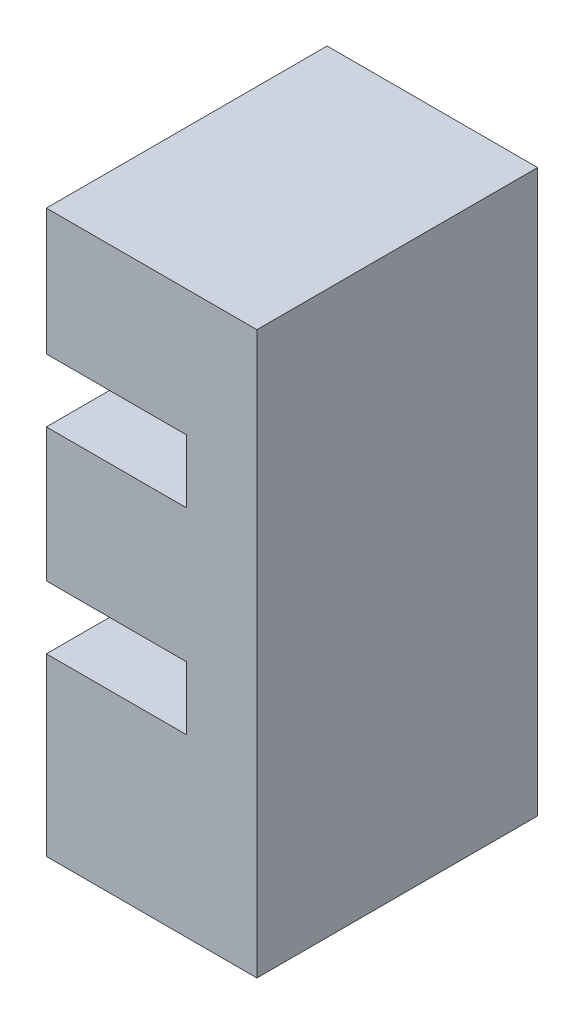
ISO-10303-21;
HEADER;
FILE_DESCRIPTION(('STEP AP214'),'2;1');
FILE_NAME('part.step','',(''),(''),'','','');
FILE_SCHEMA(('AUTOMOTIVE_DESIGN { 1 0 10303 214 1 1 1 1 }'));
ENDSEC;
DATA;
#1=APPLICATION_CONTEXT('core data for automotive mechanical design processes');
#2=APPLICATION_PROTOCOL_DEFINITION('international standard','automotive_design',2000,#1);
#3=PRODUCT_CONTEXT('',#1,'mechanical');
#4=PRODUCT('Part','Part','',(#3));
#5=PRODUCT_RELATED_PRODUCT_CATEGORY('part','',(#4));
#6=PRODUCT_DEFINITION_FORMATION('','',#4);
#7=PRODUCT_DEFINITION_CONTEXT('part definition',#1,'design');
#8=PRODUCT_DEFINITION('design','',#6,#7);
#9=PRODUCT_DEFINITION_SHAPE('','',#8);
#10=(LENGTH_UNIT() NAMED_UNIT(*) SI_UNIT(.MILLI.,.METRE.));
#11=(NAMED_UNIT(*) PLANE_ANGLE_UNIT() SI_UNIT($,.RADIAN.));
#12=(NAMED_UNIT(*) SI_UNIT($,.STERADIAN.) SOLID_ANGLE_UNIT());
#13=UNCERTAINTY_MEASURE_WITH_UNIT(LENGTH_MEASURE(1.E-05),#10,'distance_accuracy_value','');
#14=(GEOMETRIC_REPRESENTATION_CONTEXT(3) GLOBAL_UNCERTAINTY_ASSIGNED_CONTEXT((#13)) GLOBAL_UNIT_ASSIGNED_CONTEXT((#10,
#11,#12)) REPRESENTATION_CONTEXT('',''));
#15=CARTESIAN_POINT('',(0.,0.,0.));
#16=DIRECTION('',(0.,0.,1.));
#17=DIRECTION('',(1.,0.,0.));
#18=AXIS2_PLACEMENT_3D('',#15,#16,#17);
#19=CARTESIAN_POINT('',(1.905,4.572,5.08));
#20=DIRECTION('',(-1.,0.,0.));
#21=DIRECTION('',(0.,-1.,0.));
#22=AXIS2_PLACEMENT_3D('',#19,#20,#21);
#23=PLANE('',#22);
#24=DIRECTION('',(0.,1.,0.));
#25=VECTOR('',#24,1.);
#26=CARTESIAN_POINT('',(1.905,4.572,0.));
#27=LINE('',#26,#25);
#28=CARTESIAN_POINT('',(1.905,-5.588,0.));
#29=VERTEX_POINT('',#28);
#30=CARTESIAN_POINT('',(1.905,4.572,0.));
#31=VERTEX_POINT('',#30);
#32=EDGE_CURVE('E153',#29,#31,#27,.T.);
#33=ORIENTED_EDGE('',*,*,#32,.T.);
#34=DIRECTION('',(0.,0.,-1.));
#35=VECTOR('',#34,1.);
#36=CARTESIAN_POINT('',(1.905,4.572,5.08));
#37=LINE('',#36,#35);
#38=CARTESIAN_POINT('',(1.905,4.572,5.08));
#39=VERTEX_POINT('',#38);
#40=EDGE_CURVE('E11',#39,#31,#37,.T.);
#41=ORIENTED_EDGE('',*,*,#40,.F.);
#42=DIRECTION('',(0.,1.,0.));
#43=VECTOR('',#42,1.);
#44=CARTESIAN_POINT('',(1.905,4.572,5.08));
#45=LINE('',#44,#43);
#46=CARTESIAN_POINT('',(1.905,-5.588,5.08));
#47=VERTEX_POINT('',#46);
#48=EDGE_CURVE('E175',#47,#39,#45,.T.);
#49=ORIENTED_EDGE('',*,*,#48,.F.);
#50=DIRECTION('',(0.,0.,-1.));
#51=VECTOR('',#50,1.);
#52=CARTESIAN_POINT('',(1.905,-5.588,5.08));
#53=LINE('',#52,#51);
#54=EDGE_CURVE('E149',#47,#29,#53,.T.);
#55=ORIENTED_EDGE('',*,*,#54,.T.);
#56=EDGE_LOOP('',(#33,#41,#49,#55));
#57=FACE_BOUND('',#56,.T.);
#58=ADVANCED_FACE('F33',(#57),#23,.F.);
#59=CARTESIAN_POINT('',(-1.905,4.572,5.08));
#60=DIRECTION('',(0.,-1.,0.));
#61=DIRECTION('',(0.,0.,-1.));
#62=AXIS2_PLACEMENT_3D('',#59,#60,#61);
#63=PLANE('',#62);
#64=DIRECTION('',(-1.,0.,0.));
#65=VECTOR('',#64,1.);
#66=CARTESIAN_POINT('',(-1.905,4.572,0.));
#67=LINE('',#66,#65);
#68=CARTESIAN_POINT('',(-1.905,4.572,0.));
#69=VERTEX_POINT('',#68);
#70=EDGE_CURVE('E156',#31,#69,#67,.T.);
#71=ORIENTED_EDGE('',*,*,#70,.T.);
#72=DIRECTION('',(0.,0.,-1.));
#73=VECTOR('',#72,1.);
#74=CARTESIAN_POINT('',(-1.905,4.572,5.08));
#75=LINE('',#74,#73);
#76=CARTESIAN_POINT('',(-1.905,4.572,5.08));
#77=VERTEX_POINT('',#76);
#78=EDGE_CURVE('E41',#77,#69,#75,.T.);
#79=ORIENTED_EDGE('',*,*,#78,.F.);
#80=DIRECTION('',(-1.,0.,0.));
#81=VECTOR('',#80,1.);
#82=CARTESIAN_POINT('',(-1.905,4.572,5.08));
#83=LINE('',#82,#81);
#84=EDGE_CURVE('E104',#39,#77,#83,.T.);
#85=ORIENTED_EDGE('',*,*,#84,.F.);
#86=ORIENTED_EDGE('',*,*,#40,.T.);
#87=EDGE_LOOP('',(#71,#79,#85,#86));
#88=FACE_BOUND('',#87,.T.);
#89=ADVANCED_FACE('F253',(#88),#63,.F.);
#90=CARTESIAN_POINT('',(-1.905,2.286,5.08));
#91=DIRECTION('',(1.,0.,0.));
#92=DIRECTION('',(0.,1.,0.));
#93=AXIS2_PLACEMENT_3D('',#90,#91,#92);
#94=PLANE('',#93);
#95=DIRECTION('',(0.,-1.,0.));
#96=VECTOR('',#95,1.);
#97=CARTESIAN_POINT('',(-1.905,2.286,0.));
#98=LINE('',#97,#96);
#99=CARTESIAN_POINT('',(-1.905,2.286,0.));
#100=VERTEX_POINT('',#99);
#101=EDGE_CURVE('E158',#69,#100,#98,.T.);
#102=ORIENTED_EDGE('',*,*,#101,.T.);
#103=DIRECTION('',(0.,0.,-1.));
#104=VECTOR('',#103,1.);
#105=CARTESIAN_POINT('',(-1.905,2.286,5.08));
#106=LINE('',#105,#104);
#107=CARTESIAN_POINT('',(-1.905,2.286,5.08));
#108=VERTEX_POINT('',#107);
#109=EDGE_CURVE('E194',#108,#100,#106,.T.);
#110=ORIENTED_EDGE('',*,*,#109,.F.);
#111=DIRECTION('',(0.,-1.,0.));
#112=VECTOR('',#111,1.);
#113=CARTESIAN_POINT('',(-1.905,2.286,5.08));
#114=LINE('',#113,#112);
#115=EDGE_CURVE('E202',#77,#108,#114,.T.);
#116=ORIENTED_EDGE('',*,*,#115,.F.);
#117=ORIENTED_EDGE('',*,*,#78,.T.);
#118=EDGE_LOOP('',(#102,#110,#116,#117));
#119=FACE_BOUND('',#118,.T.);
#120=ADVANCED_FACE('F200',(#119),#94,.F.);
#121=CARTESIAN_POINT('',(0.635000000000001,2.286,5.08));
#122=DIRECTION('',(0.,1.,0.));
#123=DIRECTION('',(-1.,0.,0.));
#124=AXIS2_PLACEMENT_3D('',#121,#122,#123);
#125=PLANE('',#124);
#126=DIRECTION('',(1.,0.,0.));
#127=VECTOR('',#126,1.);
#128=CARTESIAN_POINT('',(0.635000000000001,2.286,0.));
#129=LINE('',#128,#127);
#130=CARTESIAN_POINT('',(0.635000000000001,2.286,0.));
#131=VERTEX_POINT('',#130);
#132=EDGE_CURVE('E160',#100,#131,#129,.T.);
#133=ORIENTED_EDGE('',*,*,#132,.T.);
#134=DIRECTION('',(0.,0.,-1.));
#135=VECTOR('',#134,1.);
#136=CARTESIAN_POINT('',(0.635000000000001,2.286,5.08));
#137=LINE('',#136,#135);
#138=CARTESIAN_POINT('',(0.635000000000001,2.286,5.08));
#139=VERTEX_POINT('',#138);
#140=EDGE_CURVE('E191',#139,#131,#137,.T.);
#141=ORIENTED_EDGE('',*,*,#140,.F.);
#142=DIRECTION('',(1.,0.,0.));
#143=VECTOR('',#142,1.);
#144=CARTESIAN_POINT('',(0.635000000000001,2.286,5.08));
#145=LINE('',#144,#143);
#146=EDGE_CURVE('E220',#108,#139,#145,.T.);
#147=ORIENTED_EDGE('',*,*,#146,.F.);
#148=ORIENTED_EDGE('',*,*,#109,.T.);
#149=EDGE_LOOP('',(#133,#141,#147,#148));
#150=FACE_BOUND('',#149,.T.);
#151=ADVANCED_FACE('F211',(#150),#125,.F.);
#152=CARTESIAN_POINT('',(0.635000000000001,1.143,5.08));
#153=DIRECTION('',(1.,0.,0.));
#154=DIRECTION('',(0.,0.,-1.));
#155=AXIS2_PLACEMENT_3D('',#152,#153,#154);
#156=PLANE('',#155);
#157=DIRECTION('',(0.,-1.,0.));
#158=VECTOR('',#157,1.);
#159=CARTESIAN_POINT('',(0.635000000000001,1.143,0.));
#160=LINE('',#159,#158);
#161=CARTESIAN_POINT('',(0.635000000000001,1.143,0.));
#162=VERTEX_POINT('',#161);
#163=EDGE_CURVE('E162',#131,#162,#160,.T.);
#164=ORIENTED_EDGE('',*,*,#163,.T.);
#165=DIRECTION('',(0.,0.,-1.));
#166=VECTOR('',#165,1.);
#167=CARTESIAN_POINT('',(0.635000000000001,1.143,5.08));
#168=LINE('',#167,#166);
#169=CARTESIAN_POINT('',(0.635000000000001,1.143,5.08));
#170=VERTEX_POINT('',#169);
#171=EDGE_CURVE('E188',#170,#162,#168,.T.);
#172=ORIENTED_EDGE('',*,*,#171,.F.);
#173=DIRECTION('',(0.,-1.,0.));
#174=VECTOR('',#173,1.);
#175=CARTESIAN_POINT('',(0.635000000000001,1.143,5.08));
#176=LINE('',#175,#174);
#177=EDGE_CURVE('E217',#139,#170,#176,.T.);
#178=ORIENTED_EDGE('',*,*,#177,.F.);
#179=ORIENTED_EDGE('',*,*,#140,.T.);
#180=EDGE_LOOP('',(#164,#172,#178,#179));
#181=FACE_BOUND('',#180,.T.);
#182=ADVANCED_FACE('F215',(#181),#156,.F.);
#183=CARTESIAN_POINT('',(-1.905,1.143,5.08));
#184=DIRECTION('',(0.,-1.,0.));
#185=DIRECTION('',(0.,0.,-1.));
#186=AXIS2_PLACEMENT_3D('',#183,#184,#185);
#187=PLANE('',#186);
#188=DIRECTION('',(-1.,0.,0.));
#189=VECTOR('',#188,1.);
#190=CARTESIAN_POINT('',(-1.905,1.143,0.));
#191=LINE('',#190,#189);
#192=CARTESIAN_POINT('',(-1.905,1.143,0.));
#193=VERTEX_POINT('',#192);
#194=EDGE_CURVE('E164',#162,#193,#191,.T.);
#195=ORIENTED_EDGE('',*,*,#194,.T.);
#196=DIRECTION('',(0.,0.,-1.));
#197=VECTOR('',#196,1.);
#198=CARTESIAN_POINT('',(-1.905,1.143,5.08));
#199=LINE('',#198,#197);
#200=CARTESIAN_POINT('',(-1.905,1.143,5.08));
#201=VERTEX_POINT('',#200);
#202=EDGE_CURVE('E185',#201,#193,#199,.T.);
#203=ORIENTED_EDGE('',*,*,#202,.F.);
#204=DIRECTION('',(-1.,0.,0.));
#205=VECTOR('',#204,1.);
#206=CARTESIAN_POINT('',(-1.905,1.143,5.08));
#207=LINE('',#206,#205);
#208=EDGE_CURVE('E219',#170,#201,#207,.T.);
#209=ORIENTED_EDGE('',*,*,#208,.F.);
#210=ORIENTED_EDGE('',*,*,#171,.T.);
#211=EDGE_LOOP('',(#195,#203,#209,#210));
#212=FACE_BOUND('',#211,.T.);
#213=ADVANCED_FACE('F266',(#212),#187,.F.);
#214=CARTESIAN_POINT('',(-1.905,1.143,5.08));
#215=DIRECTION('',(1.,0.,0.));
#216=DIRECTION('',(0.,0.,-1.));
#217=AXIS2_PLACEMENT_3D('',#214,#215,#216);
#218=PLANE('',#217);
#219=DIRECTION('',(0.,-1.,0.));
#220=VECTOR('',#219,1.);
#221=CARTESIAN_POINT('',(-1.905,1.143,0.));
#222=LINE('',#221,#220);
#223=CARTESIAN_POINT('',(-1.905,-1.27,0.));
#224=VERTEX_POINT('',#223);
#225=EDGE_CURVE('E166',#193,#224,#222,.T.);
#226=ORIENTED_EDGE('',*,*,#225,.T.);
#227=DIRECTION('',(0.,0.,-1.));
#228=VECTOR('',#227,1.);
#229=CARTESIAN_POINT('',(-1.905,-1.27,5.08));
#230=LINE('',#229,#228);
#231=CARTESIAN_POINT('',(-1.905,-1.27,5.08));
#232=VERTEX_POINT('',#231);
#233=EDGE_CURVE('E182',#232,#224,#230,.T.);
#234=ORIENTED_EDGE('',*,*,#233,.F.);
#235=DIRECTION('',(0.,-1.,0.));
#236=VECTOR('',#235,1.);
#237=CARTESIAN_POINT('',(-1.905,1.143,5.08));
#238=LINE('',#237,#236);
#239=EDGE_CURVE('E222',#201,#232,#238,.T.);
#240=ORIENTED_EDGE('',*,*,#239,.F.);
#241=ORIENTED_EDGE('',*,*,#202,.T.);
#242=EDGE_LOOP('',(#226,#234,#240,#241));
#243=FACE_BOUND('',#242,.T.);
#244=ADVANCED_FACE('F269',(#243),#218,.F.);
#245=CARTESIAN_POINT('',(-1.905,-1.27,5.08));
#246=DIRECTION('',(0.,1.,0.));
#247=DIRECTION('',(-1.,0.,0.));
#248=AXIS2_PLACEMENT_3D('',#245,#246,#247);
#249=PLANE('',#248);
#250=DIRECTION('',(1.,0.,0.));
#251=VECTOR('',#250,1.);
#252=CARTESIAN_POINT('',(-1.905,-1.27,0.));
#253=LINE('',#252,#251);
#254=CARTESIAN_POINT('',(0.635000000000001,-1.27,0.));
#255=VERTEX_POINT('',#254);
#256=EDGE_CURVE('E168',#224,#255,#253,.T.);
#257=ORIENTED_EDGE('',*,*,#256,.T.);
#258=DIRECTION('',(0.,0.,-1.));
#259=VECTOR('',#258,1.);
#260=CARTESIAN_POINT('',(0.635000000000001,-1.27,5.08));
#261=LINE('',#260,#259);
#262=CARTESIAN_POINT('',(0.635000000000001,-1.27,5.08));
#263=VERTEX_POINT('',#262);
#264=EDGE_CURVE('E179',#263,#255,#261,.T.);
#265=ORIENTED_EDGE('',*,*,#264,.F.);
#266=DIRECTION('',(1.,0.,0.));
#267=VECTOR('',#266,1.);
#268=CARTESIAN_POINT('',(-1.905,-1.27,5.08));
#269=LINE('',#268,#267);
#270=EDGE_CURVE('E228',#232,#263,#269,.T.);
#271=ORIENTED_EDGE('',*,*,#270,.F.);
#272=ORIENTED_EDGE('',*,*,#233,.T.);
#273=EDGE_LOOP('',(#257,#265,#271,#272));
#274=FACE_BOUND('',#273,.T.);
#275=ADVANCED_FACE('F234',(#274),#249,.F.);
#276=CARTESIAN_POINT('',(0.635000000000001,-1.27,5.08));
#277=DIRECTION('',(1.,0.,0.));
#278=DIRECTION('',(0.,0.,-1.));
#279=AXIS2_PLACEMENT_3D('',#276,#277,#278);
#280=PLANE('',#279);
#281=DIRECTION('',(0.,-1.,0.));
#282=VECTOR('',#281,1.);
#283=CARTESIAN_POINT('',(0.635000000000001,-1.27,0.));
#284=LINE('',#283,#282);
#285=CARTESIAN_POINT('',(0.635000000000001,-2.413,0.));
#286=VERTEX_POINT('',#285);
#287=EDGE_CURVE('E170',#255,#286,#284,.T.);
#288=ORIENTED_EDGE('',*,*,#287,.T.);
#289=DIRECTION('',(0.,0.,-1.));
#290=VECTOR('',#289,1.);
#291=CARTESIAN_POINT('',(0.635000000000001,-2.413,5.08));
#292=LINE('',#291,#290);
#293=CARTESIAN_POINT('',(0.635000000000001,-2.413,5.08));
#294=VERTEX_POINT('',#293);
#295=EDGE_CURVE('E144',#294,#286,#292,.T.);
#296=ORIENTED_EDGE('',*,*,#295,.F.);
#297=DIRECTION('',(0.,-1.,0.));
#298=VECTOR('',#297,1.);
#299=CARTESIAN_POINT('',(0.635000000000001,-1.27,5.08));
#300=LINE('',#299,#298);
#301=EDGE_CURVE('E135',#263,#294,#300,.T.);
#302=ORIENTED_EDGE('',*,*,#301,.F.);
#303=ORIENTED_EDGE('',*,*,#264,.T.);
#304=EDGE_LOOP('',(#288,#296,#302,#303));
#305=FACE_BOUND('',#304,.T.);
#306=ADVANCED_FACE('F238',(#305),#280,.F.);
#307=CARTESIAN_POINT('',(0.635000000000001,-2.413,5.08));
#308=DIRECTION('',(0.,-1.,0.));
#309=DIRECTION('',(0.,0.,-1.));
#310=AXIS2_PLACEMENT_3D('',#307,#308,#309);
#311=PLANE('',#310);
#312=DIRECTION('',(-1.,0.,0.));
#313=VECTOR('',#312,1.);
#314=CARTESIAN_POINT('',(0.635000000000001,-2.413,0.));
#315=LINE('',#314,#313);
#316=CARTESIAN_POINT('',(-1.905,-2.413,0.));
#317=VERTEX_POINT('',#316);
#318=EDGE_CURVE('E143',#286,#317,#315,.T.);
#319=ORIENTED_EDGE('',*,*,#318,.T.);
#320=DIRECTION('',(0.,0.,-1.));
#321=VECTOR('',#320,1.);
#322=CARTESIAN_POINT('',(-1.905,-2.413,5.08));
#323=LINE('',#322,#321);
#324=CARTESIAN_POINT('',(-1.905,-2.413,5.08));
#325=VERTEX_POINT('',#324);
#326=EDGE_CURVE('E140',#325,#317,#323,.T.);
#327=ORIENTED_EDGE('',*,*,#326,.F.);
#328=DIRECTION('',(-1.,0.,0.));
#329=VECTOR('',#328,1.);
#330=CARTESIAN_POINT('',(0.635000000000001,-2.413,5.08));
#331=LINE('',#330,#329);
#332=EDGE_CURVE('E129',#294,#325,#331,.T.);
#333=ORIENTED_EDGE('',*,*,#332,.F.);
#334=ORIENTED_EDGE('',*,*,#295,.T.);
#335=EDGE_LOOP('',(#319,#327,#333,#334));
#336=FACE_BOUND('',#335,.T.);
#337=ADVANCED_FACE('F141',(#336),#311,.F.);
#338=CARTESIAN_POINT('',(-1.905,-2.413,5.08));
#339=DIRECTION('',(1.,0.,0.));
#340=DIRECTION('',(0.,1.,0.));
#341=AXIS2_PLACEMENT_3D('',#338,#339,#340);
#342=PLANE('',#341);
#343=DIRECTION('',(0.,-1.,0.));
#344=VECTOR('',#343,1.);
#345=CARTESIAN_POINT('',(-1.905,-2.413,0.));
#346=LINE('',#345,#344);
#347=CARTESIAN_POINT('',(-1.905,-5.588,0.));
#348=VERTEX_POINT('',#347);
#349=EDGE_CURVE('E90',#317,#348,#346,.T.);
#350=ORIENTED_EDGE('',*,*,#349,.T.);
#351=DIRECTION('',(0.,0.,-1.));
#352=VECTOR('',#351,1.);
#353=CARTESIAN_POINT('',(-1.905,-5.588,5.08));
#354=LINE('',#353,#352);
#355=CARTESIAN_POINT('',(-1.905,-5.588,5.08));
#356=VERTEX_POINT('',#355);
#357=EDGE_CURVE('E145',#356,#348,#354,.T.);
#358=ORIENTED_EDGE('',*,*,#357,.F.);
#359=DIRECTION('',(0.,-1.,0.));
#360=VECTOR('',#359,1.);
#361=CARTESIAN_POINT('',(-1.905,-2.413,5.08));
#362=LINE('',#361,#360);
#363=EDGE_CURVE('E133',#325,#356,#362,.T.);
#364=ORIENTED_EDGE('',*,*,#363,.F.);
#365=ORIENTED_EDGE('',*,*,#326,.T.);
#366=EDGE_LOOP('',(#350,#358,#364,#365));
#367=FACE_BOUND('',#366,.T.);
#368=ADVANCED_FACE('F147',(#367),#342,.F.);
#369=CARTESIAN_POINT('',(-1.905,-5.588,5.08));
#370=DIRECTION('',(0.,1.,0.));
#371=DIRECTION('',(-1.,0.,0.));
#372=AXIS2_PLACEMENT_3D('',#369,#370,#371);
#373=PLANE('',#372);
#374=DIRECTION('',(1.,0.,0.));
#375=VECTOR('',#374,1.);
#376=CARTESIAN_POINT('',(-1.905,-5.588,0.));
#377=LINE('',#376,#375);
#378=EDGE_CURVE('E96',#348,#29,#377,.T.);
#379=ORIENTED_EDGE('',*,*,#378,.T.);
#380=ORIENTED_EDGE('',*,*,#54,.F.);
#381=DIRECTION('',(1.,0.,0.));
#382=VECTOR('',#381,1.);
#383=CARTESIAN_POINT('',(-1.905,-5.588,5.08));
#384=LINE('',#383,#382);
#385=EDGE_CURVE('E49',#356,#47,#384,.T.);
#386=ORIENTED_EDGE('',*,*,#385,.F.);
#387=ORIENTED_EDGE('',*,*,#357,.T.);
#388=EDGE_LOOP('',(#379,#380,#386,#387));
#389=FACE_BOUND('',#388,.T.);
#390=ADVANCED_FACE('F242',(#389),#373,.F.);
#391=CARTESIAN_POINT('',(0.,0.,5.08));
#392=DIRECTION('',(0.,0.,1.));
#393=DIRECTION('',(1.,0.,0.));
#394=AXIS2_PLACEMENT_3D('',#391,#392,#393);
#395=PLANE('',#394);
#396=ORIENTED_EDGE('',*,*,#48,.T.);
#397=ORIENTED_EDGE('',*,*,#84,.T.);
#398=ORIENTED_EDGE('',*,*,#115,.T.);
#399=ORIENTED_EDGE('',*,*,#146,.T.);
#400=ORIENTED_EDGE('',*,*,#177,.T.);
#401=ORIENTED_EDGE('',*,*,#208,.T.);
#402=ORIENTED_EDGE('',*,*,#239,.T.);
#403=ORIENTED_EDGE('',*,*,#270,.T.);
#404=ORIENTED_EDGE('',*,*,#301,.T.);
#405=ORIENTED_EDGE('',*,*,#332,.T.);
#406=ORIENTED_EDGE('',*,*,#363,.T.);
#407=ORIENTED_EDGE('',*,*,#385,.T.);
#408=EDGE_LOOP('',(#396,#397,#398,#399,#400,#401,#402,#403,#404,#405,#406,#407));
#409=FACE_BOUND('',#408,.T.);
#410=ADVANCED_FACE('F131',(#409),#395,.T.);
#411=CARTESIAN_POINT('',(0.,0.,0.));
#412=DIRECTION('',(0.,0.,1.));
#413=DIRECTION('',(1.,0.,0.));
#414=AXIS2_PLACEMENT_3D('',#411,#412,#413);
#415=PLANE('',#414);
#416=ORIENTED_EDGE('',*,*,#32,.F.);
#417=ORIENTED_EDGE('',*,*,#378,.F.);
#418=ORIENTED_EDGE('',*,*,#349,.F.);
#419=ORIENTED_EDGE('',*,*,#318,.F.);
#420=ORIENTED_EDGE('',*,*,#287,.F.);
#421=ORIENTED_EDGE('',*,*,#256,.F.);
#422=ORIENTED_EDGE('',*,*,#225,.F.);
#423=ORIENTED_EDGE('',*,*,#194,.F.);
#424=ORIENTED_EDGE('',*,*,#163,.F.);
#425=ORIENTED_EDGE('',*,*,#132,.F.);
#426=ORIENTED_EDGE('',*,*,#101,.F.);
#427=ORIENTED_EDGE('',*,*,#70,.F.);
#428=EDGE_LOOP('',(#416,#417,#418,#419,#420,#421,#422,#423,#424,#425,#426,#427));
#429=FACE_BOUND('',#428,.T.);
#430=ADVANCED_FACE('F206',(#429),#415,.F.);
#431=CLOSED_SHELL('',(#58,#89,#120,#151,#182,#213,#244,#275,#306,#337,#368,#390,#410,#430));
#432=MANIFOLD_SOLID_BREP('B2',#431);
#433=ADVANCED_BREP_SHAPE_REPRESENTATION('',(#18,#432),#14);
#434=SHAPE_DEFINITION_REPRESENTATION(#9,#433);
ENDSEC;
END-ISO-10303-21;
